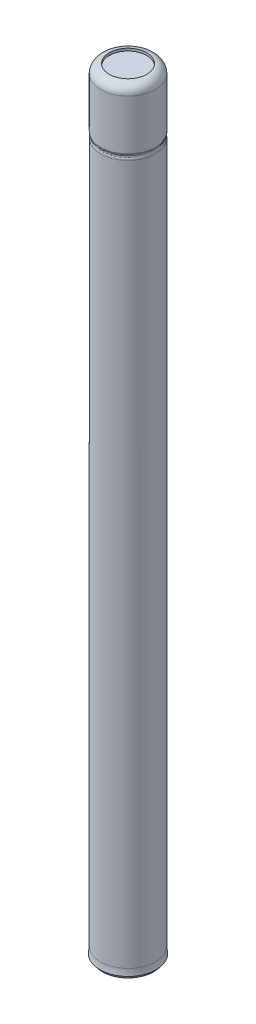
ISO-10303-21;
HEADER;
FILE_DESCRIPTION(('STEP AP214'),'2;1');
FILE_NAME('part.step','',(''),(''),'','','');
FILE_SCHEMA(('AUTOMOTIVE_DESIGN { 1 0 10303 214 1 1 1 1 }'));
ENDSEC;
DATA;
#1=APPLICATION_CONTEXT('core data for automotive mechanical design processes');
#2=APPLICATION_PROTOCOL_DEFINITION('international standard','automotive_design',2000,#1);
#3=PRODUCT_CONTEXT('',#1,'mechanical');
#4=PRODUCT('Part','Part','',(#3));
#5=PRODUCT_RELATED_PRODUCT_CATEGORY('part','',(#4));
#6=PRODUCT_DEFINITION_FORMATION('','',#4);
#7=PRODUCT_DEFINITION_CONTEXT('part definition',#1,'design');
#8=PRODUCT_DEFINITION('design','',#6,#7);
#9=PRODUCT_DEFINITION_SHAPE('','',#8);
#10=(LENGTH_UNIT() NAMED_UNIT(*) SI_UNIT(.MILLI.,.METRE.));
#11=(NAMED_UNIT(*) PLANE_ANGLE_UNIT() SI_UNIT($,.RADIAN.));
#12=(NAMED_UNIT(*) SI_UNIT($,.STERADIAN.) SOLID_ANGLE_UNIT());
#13=UNCERTAINTY_MEASURE_WITH_UNIT(LENGTH_MEASURE(1.E-05),#10,'distance_accuracy_value','');
#14=(GEOMETRIC_REPRESENTATION_CONTEXT(3) GLOBAL_UNCERTAINTY_ASSIGNED_CONTEXT((#13)) GLOBAL_UNIT_ASSIGNED_CONTEXT((#10,
#11,#12)) REPRESENTATION_CONTEXT('',''));
#15=CARTESIAN_POINT('',(0.,0.,0.));
#16=DIRECTION('',(0.,0.,1.));
#17=DIRECTION('',(1.,0.,0.));
#18=AXIS2_PLACEMENT_3D('',#15,#16,#17);
#19=CARTESIAN_POINT('',(9.00067715361432,0.,0.));
#20=DIRECTION('',(0.,-1.,0.));
#21=DIRECTION('',(1.,0.,0.));
#22=AXIS2_PLACEMENT_3D('',#19,#20,#21);
#23=PLANE('',#22);
#24=CARTESIAN_POINT('',(0.,0.,0.));
#25=DIRECTION('',(0.,-1.,0.));
#26=DIRECTION('',(1.,0.,0.));
#27=AXIS2_PLACEMENT_3D('',#24,#25,#26);
#28=CIRCLE('',#27,8.25067715361432);
#29=CARTESIAN_POINT('',(8.25067715361432,0.,0.));
#30=VERTEX_POINT('',#29);
#31=EDGE_CURVE('E38',#30,#30,#28,.T.);
#32=ORIENTED_EDGE('',*,*,#31,.T.);
#33=EDGE_LOOP('',(#32));
#34=FACE_BOUND('',#33,.T.);
#35=ADVANCED_FACE('F30',(#34),#23,.T.);
#36=CARTESIAN_POINT('',(0.,0.,0.));
#37=DIRECTION('',(0.,-1.,0.));
#38=DIRECTION('',(1.,0.,0.));
#39=AXIS2_PLACEMENT_3D('',#36,#37,#38);
#40=CYLINDRICAL_SURFACE('',#39,9.00067715361432);
#41=CARTESIAN_POINT('',(0.,0.750000000000001,0.));
#42=DIRECTION('',(0.,-1.,0.));
#43=DIRECTION('',(1.,0.,0.));
#44=AXIS2_PLACEMENT_3D('',#41,#42,#43);
#45=CIRCLE('',#44,9.00067715361432);
#46=CARTESIAN_POINT('',(9.00067715361432,0.749999999999999,0.));
#47=VERTEX_POINT('',#46);
#48=EDGE_CURVE('E10',#47,#47,#45,.F.);
#49=ORIENTED_EDGE('',*,*,#48,.T.);
#50=EDGE_LOOP('',(#49));
#51=FACE_BOUND('',#50,.T.);
#52=CARTESIAN_POINT('',(0.,1.2,0.));
#53=DIRECTION('',(0.,-1.,0.));
#54=DIRECTION('',(1.,0.,0.));
#55=AXIS2_PLACEMENT_3D('',#52,#53,#54);
#56=CIRCLE('',#55,9.00067715361432);
#57=CARTESIAN_POINT('',(9.00067715361432,1.2,0.));
#58=VERTEX_POINT('',#57);
#59=EDGE_CURVE('E65',#58,#58,#56,.T.);
#60=ORIENTED_EDGE('',*,*,#59,.T.);
#61=EDGE_LOOP('',(#60));
#62=FACE_BOUND('',#61,.T.);
#63=ADVANCED_FACE('F104',(#51,#62),#40,.T.);
#64=CARTESIAN_POINT('',(9.54678994123106,1.2,0.));
#65=DIRECTION('',(0.,-1.,0.));
#66=DIRECTION('',(1.,0.,0.));
#67=AXIS2_PLACEMENT_3D('',#64,#65,#66);
#68=PLANE('',#67);
#69=CARTESIAN_POINT('',(0.,1.2,0.));
#70=DIRECTION('',(0.,-1.,0.));
#71=DIRECTION('',(1.,0.,0.));
#72=AXIS2_PLACEMENT_3D('',#69,#70,#71);
#73=CIRCLE('',#72,9.54678994123106);
#74=CARTESIAN_POINT('',(9.54678994123106,1.2,0.));
#75=VERTEX_POINT('',#74);
#76=EDGE_CURVE('E68',#75,#75,#73,.T.);
#77=ORIENTED_EDGE('',*,*,#76,.T.);
#78=EDGE_LOOP('',(#77));
#79=FACE_BOUND('',#78,.T.);
#80=ORIENTED_EDGE('',*,*,#59,.F.);
#81=EDGE_LOOP('',(#80));
#82=FACE_BOUND('',#81,.T.);
#83=ADVANCED_FACE('F110',(#79,#82),#68,.T.);
#84=CARTESIAN_POINT('',(0.,3.41058303363862,0.));
#85=DIRECTION('',(0.,-1.,0.));
#86=DIRECTION('',(1.,0.,0.));
#87=AXIS2_PLACEMENT_3D('',#84,#85,#86);
#88=TOROIDAL_SURFACE('',#87,21.2589535986631,11.9189535986631);
#89=CARTESIAN_POINT('',(0.,3.41058303363862,0.));
#90=DIRECTION('',(0.,-1.,0.));
#91=DIRECTION('',(1.,0.,0.));
#92=AXIS2_PLACEMENT_3D('',#89,#90,#91);
#93=CIRCLE('',#92,9.34000000000005);
#94=CARTESIAN_POINT('',(9.34000000000005,3.41058303363862,0.));
#95=VERTEX_POINT('',#94);
#96=EDGE_CURVE('E71',#95,#95,#93,.T.);
#97=ORIENTED_EDGE('',*,*,#96,.T.);
#98=EDGE_LOOP('',(#97));
#99=FACE_BOUND('',#98,.T.);
#100=ORIENTED_EDGE('',*,*,#76,.F.);
#101=EDGE_LOOP('',(#100));
#102=FACE_BOUND('',#101,.T.);
#103=ADVANCED_FACE('F134',(#99,#102),#88,.F.);
#104=CARTESIAN_POINT('',(0.,0.,0.));
#105=DIRECTION('',(0.,-1.,0.));
#106=DIRECTION('',(1.,0.,0.));
#107=AXIS2_PLACEMENT_3D('',#104,#105,#106);
#108=CYLINDRICAL_SURFACE('',#107,9.34000000000003);
#109=CARTESIAN_POINT('',(0.,241.526572243449,0.));
#110=DIRECTION('',(0.,1.,0.));
#111=DIRECTION('',(-1.,0.,0.));
#112=AXIS2_PLACEMENT_3D('',#109,#110,#111);
#113=CIRCLE('',#112,9.34000000000003);
#114=CARTESIAN_POINT('',(-9.33999999999998,241.526572243449,0.));
#115=VERTEX_POINT('',#114);
#116=EDGE_CURVE('E42',#115,#115,#113,.F.);
#117=ORIENTED_EDGE('',*,*,#116,.T.);
#118=EDGE_LOOP('',(#117));
#119=FACE_BOUND('',#118,.T.);
#120=ORIENTED_EDGE('',*,*,#96,.F.);
#121=EDGE_LOOP('',(#120));
#122=FACE_BOUND('',#121,.T.);
#123=ADVANCED_FACE('F131',(#119,#122),#108,.T.);
#124=CARTESIAN_POINT('',(0.,241.669950732985,0.));
#125=DIRECTION('',(0.,-1.,0.));
#126=DIRECTION('',(1.,0.,0.));
#127=AXIS2_PLACEMENT_3D('',#124,#125,#126);
#128=CONICAL_SURFACE('',#127,9.34,0.377784422591841);
#129=CARTESIAN_POINT('',(0.,242.248353475755,0.));
#130=DIRECTION('',(0.,-1.,0.));
#131=DIRECTION('',(1.,0.,0.));
#132=AXIS2_PLACEMENT_3D('',#129,#130,#131);
#133=CIRCLE('',#132,9.11046320884024);
#134=CARTESIAN_POINT('',(9.11046320884029,242.248353475755,0.));
#135=VERTEX_POINT('',#134);
#136=EDGE_CURVE('E47',#135,#135,#133,.T.);
#137=ORIENTED_EDGE('',*,*,#136,.T.);
#138=EDGE_LOOP('',(#137));
#139=FACE_BOUND('',#138,.T.);
#140=CARTESIAN_POINT('',(0.,241.803218767694,0.));
#141=DIRECTION('',(0.,1.,0.));
#142=DIRECTION('',(-1.,0.,0.));
#143=AXIS2_PLACEMENT_3D('',#140,#141,#142);
#144=CIRCLE('',#143,9.28711311895804);
#145=CARTESIAN_POINT('',(-9.28711311895799,241.803218767694,0.));
#146=VERTEX_POINT('',#145);
#147=EDGE_CURVE('E50',#146,#146,#144,.T.);
#148=ORIENTED_EDGE('',*,*,#147,.T.);
#149=EDGE_LOOP('',(#148));
#150=FACE_BOUND('',#149,.T.);
#151=ADVANCED_FACE('F99',(#139,#150),#128,.T.);
#152=CARTESIAN_POINT('',(0.,242.525,0.));
#153=DIRECTION('',(0.,1.,0.));
#154=DIRECTION('',(-1.,0.,0.));
#155=AXIS2_PLACEMENT_3D('',#152,#153,#154);
#156=CONICAL_SURFACE('',#155,9.00067715361427,0.377784422591841);
#157=CARTESIAN_POINT('',(0.,243.246781232306,0.));
#158=DIRECTION('',(0.,-1.,0.));
#159=DIRECTION('',(1.,0.,0.));
#160=AXIS2_PLACEMENT_3D('',#157,#158,#159);
#161=CIRCLE('',#160,9.28711311895799);
#162=CARTESIAN_POINT('',(9.28711311895804,243.246781232306,0.));
#163=VERTEX_POINT('',#162);
#164=EDGE_CURVE('E56',#163,#163,#161,.T.);
#165=ORIENTED_EDGE('',*,*,#164,.T.);
#166=EDGE_LOOP('',(#165));
#167=FACE_BOUND('',#166,.T.);
#168=CARTESIAN_POINT('',(0.,242.801646524245,0.));
#169=DIRECTION('',(0.,1.,0.));
#170=DIRECTION('',(-1.,0.,0.));
#171=AXIS2_PLACEMENT_3D('',#168,#169,#170);
#172=CIRCLE('',#171,9.11046320884023);
#173=CARTESIAN_POINT('',(-9.11046320884018,242.801646524245,0.));
#174=VERTEX_POINT('',#173);
#175=EDGE_CURVE('E59',#174,#174,#172,.T.);
#176=ORIENTED_EDGE('',*,*,#175,.T.);
#177=EDGE_LOOP('',(#176));
#178=FACE_BOUND('',#177,.T.);
#179=ADVANCED_FACE('F93',(#167,#178),#156,.T.);
#180=CARTESIAN_POINT('',(0.,0.,0.));
#181=DIRECTION('',(0.,-1.,0.));
#182=DIRECTION('',(1.,0.,0.));
#183=AXIS2_PLACEMENT_3D('',#180,#181,#182);
#184=CYLINDRICAL_SURFACE('',#183,9.34);
#185=CARTESIAN_POINT('',(0.,243.523427756551,0.));
#186=DIRECTION('',(0.,1.,0.));
#187=DIRECTION('',(-1.,0.,0.));
#188=AXIS2_PLACEMENT_3D('',#185,#186,#187);
#189=CIRCLE('',#188,9.34);
#190=CARTESIAN_POINT('',(-9.33999999999995,243.523427756551,0.));
#191=VERTEX_POINT('',#190);
#192=EDGE_CURVE('E53',#191,#191,#189,.T.);
#193=ORIENTED_EDGE('',*,*,#192,.T.);
#194=EDGE_LOOP('',(#193));
#195=FACE_BOUND('',#194,.T.);
#196=CARTESIAN_POINT('',(0.,260.525,0.));
#197=DIRECTION('',(0.,1.,0.));
#198=DIRECTION('',(-1.,0.,0.));
#199=AXIS2_PLACEMENT_3D('',#196,#197,#198);
#200=CIRCLE('',#199,9.34);
#201=CARTESIAN_POINT('',(-9.33999999999994,260.525,0.));
#202=VERTEX_POINT('',#201);
#203=EDGE_CURVE('E62',#202,#202,#200,.F.);
#204=ORIENTED_EDGE('',*,*,#203,.T.);
#205=EDGE_LOOP('',(#204));
#206=FACE_BOUND('',#205,.T.);
#207=ADVANCED_FACE('F88',(#195,#206),#184,.T.);
#208=CARTESIAN_POINT('',(0.,260.525,0.));
#209=DIRECTION('',(0.,1.,0.));
#210=DIRECTION('',(-1.,0.,0.));
#211=AXIS2_PLACEMENT_3D('',#208,#209,#210);
#212=TOROIDAL_SURFACE('',#211,6.34,3.);
#213=CARTESIAN_POINT('',(0.,263.52473332148,0.));
#214=DIRECTION('',(0.,-1.,0.));
#215=DIRECTION('',(1.,0.,0.));
#216=AXIS2_PLACEMENT_3D('',#213,#214,#215);
#217=CIRCLE('',#216,6.38);
#218=CARTESIAN_POINT('',(6.38000000000005,263.52473332148,0.));
#219=VERTEX_POINT('',#218);
#220=EDGE_CURVE('E34',#219,#219,#217,.F.);
#221=ORIENTED_EDGE('',*,*,#220,.F.);
#222=EDGE_LOOP('',(#221));
#223=FACE_BOUND('',#222,.T.);
#224=ORIENTED_EDGE('',*,*,#203,.F.);
#225=EDGE_LOOP('',(#224));
#226=FACE_BOUND('',#225,.T.);
#227=ADVANCED_FACE('F84',(#223,#226),#212,.T.);
#228=CARTESIAN_POINT('',(0.,243.523427756551,0.));
#229=DIRECTION('',(0.,1.,0.));
#230=DIRECTION('',(-1.,0.,0.));
#231=AXIS2_PLACEMENT_3D('',#228,#229,#230);
#232=TOROIDAL_SURFACE('',#231,8.59,0.75);
#233=ORIENTED_EDGE('',*,*,#192,.F.);
#234=EDGE_LOOP('',(#233));
#235=FACE_BOUND('',#234,.T.);
#236=ORIENTED_EDGE('',*,*,#164,.F.);
#237=EDGE_LOOP('',(#236));
#238=FACE_BOUND('',#237,.T.);
#239=ADVANCED_FACE('F87',(#235,#238),#232,.T.);
#240=CARTESIAN_POINT('',(0.,242.525,0.));
#241=DIRECTION('',(0.,-1.,0.));
#242=DIRECTION('',(1.,0.,0.));
#243=AXIS2_PLACEMENT_3D('',#240,#241,#242);
#244=TOROIDAL_SURFACE('',#243,9.80757632779822,0.75);
#245=ORIENTED_EDGE('',*,*,#175,.F.);
#246=EDGE_LOOP('',(#245));
#247=FACE_BOUND('',#246,.T.);
#248=ORIENTED_EDGE('',*,*,#136,.F.);
#249=EDGE_LOOP('',(#248));
#250=FACE_BOUND('',#249,.T.);
#251=ADVANCED_FACE('F116',(#247,#250),#244,.F.);
#252=CARTESIAN_POINT('',(0.,241.526572243449,0.));
#253=DIRECTION('',(0.,1.,0.));
#254=DIRECTION('',(-1.,0.,0.));
#255=AXIS2_PLACEMENT_3D('',#252,#253,#254);
#256=TOROIDAL_SURFACE('',#255,8.59000000000003,0.75);
#257=ORIENTED_EDGE('',*,*,#147,.F.);
#258=EDGE_LOOP('',(#257));
#259=FACE_BOUND('',#258,.T.);
#260=ORIENTED_EDGE('',*,*,#116,.F.);
#261=EDGE_LOOP('',(#260));
#262=FACE_BOUND('',#261,.T.);
#263=ADVANCED_FACE('F119',(#259,#262),#256,.T.);
#264=CARTESIAN_POINT('',(0.,0.750000000000001,0.));
#265=DIRECTION('',(0.,-1.,0.));
#266=DIRECTION('',(1.,0.,0.));
#267=AXIS2_PLACEMENT_3D('',#264,#265,#266);
#268=TOROIDAL_SURFACE('',#267,8.25067715361432,0.75);
#269=ORIENTED_EDGE('',*,*,#48,.F.);
#270=EDGE_LOOP('',(#269));
#271=FACE_BOUND('',#270,.T.);
#272=ORIENTED_EDGE('',*,*,#31,.F.);
#273=EDGE_LOOP('',(#272));
#274=FACE_BOUND('',#273,.T.);
#275=ADVANCED_FACE('F32',(#271,#274),#268,.T.);
#276=CARTESIAN_POINT('',(0.,262.675,0.));
#277=DIRECTION('',(0.,1.,0.));
#278=DIRECTION('',(-1.,0.,0.));
#279=AXIS2_PLACEMENT_3D('',#276,#277,#278);
#280=CYLINDRICAL_SURFACE('',#279,6.38);
#281=ORIENTED_EDGE('',*,*,#220,.T.);
#282=EDGE_LOOP('',(#281));
#283=FACE_BOUND('',#282,.T.);
#284=CARTESIAN_POINT('',(0.,262.675,0.));
#285=DIRECTION('',(0.,1.,0.));
#286=DIRECTION('',(-1.,0.,0.));
#287=AXIS2_PLACEMENT_3D('',#284,#285,#286);
#288=CIRCLE('',#287,6.38);
#289=CARTESIAN_POINT('',(-6.37999999999994,262.675,0.));
#290=VERTEX_POINT('',#289);
#291=EDGE_CURVE('E74',#290,#290,#288,.T.);
#292=ORIENTED_EDGE('',*,*,#291,.F.);
#293=EDGE_LOOP('',(#292));
#294=FACE_BOUND('',#293,.T.);
#295=ADVANCED_FACE('F81',(#283,#294),#280,.F.);
#296=CARTESIAN_POINT('',(0.,262.675,0.));
#297=DIRECTION('',(0.,1.,0.));
#298=DIRECTION('',(-1.,0.,0.));
#299=AXIS2_PLACEMENT_3D('',#296,#297,#298);
#300=PLANE('',#299);
#301=ORIENTED_EDGE('',*,*,#291,.T.);
#302=EDGE_LOOP('',(#301));
#303=FACE_BOUND('',#302,.T.);
#304=ADVANCED_FACE('F204',(#303),#300,.T.);
#305=CLOSED_SHELL('',(#35,#63,#83,#103,#123,#151,#179,#207,#227,#239,#251,#263,#275,#295,#304));
#306=MANIFOLD_SOLID_BREP('B2',#305);
#307=ADVANCED_BREP_SHAPE_REPRESENTATION('',(#18,#306),#14);
#308=SHAPE_DEFINITION_REPRESENTATION(#9,#307);
ENDSEC;
END-ISO-10303-21;
